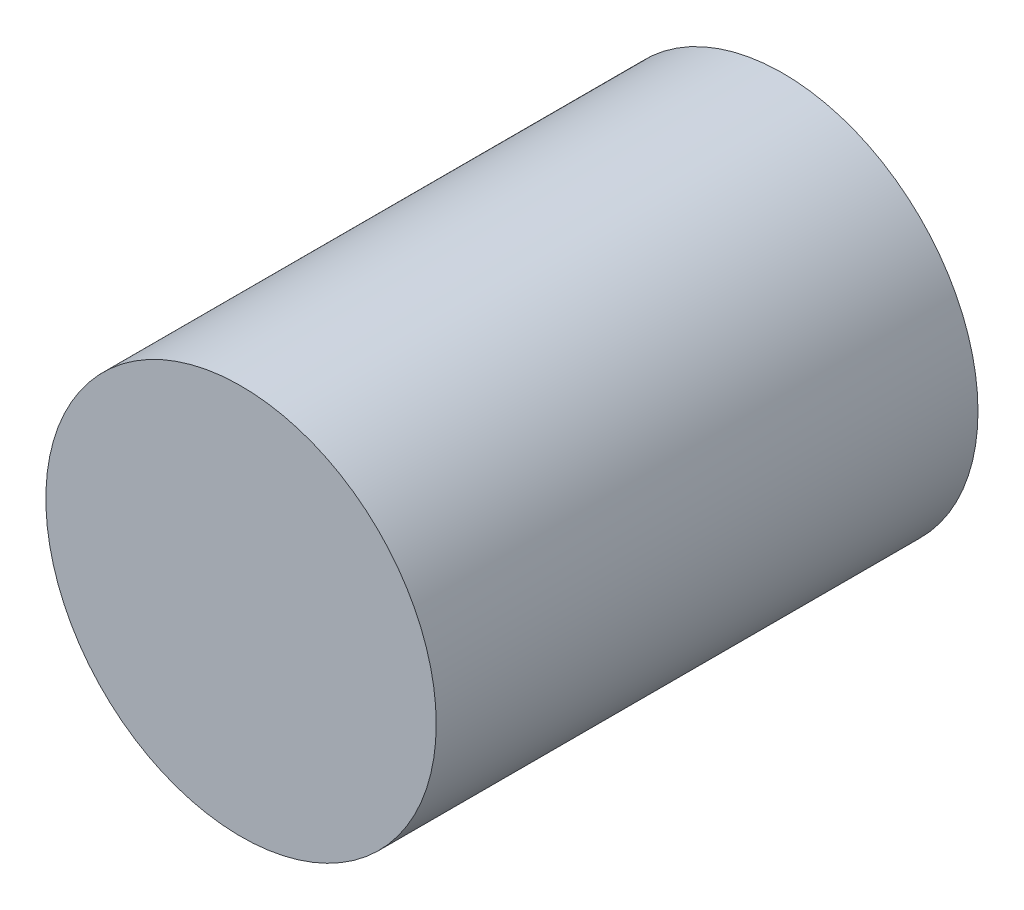
ISO-10303-21;
HEADER;
FILE_DESCRIPTION(('STEP AP214'),'2;1');
FILE_NAME('part.step','',(''),(''),'','','');
FILE_SCHEMA(('AUTOMOTIVE_DESIGN { 1 0 10303 214 1 1 1 1 }'));
ENDSEC;
DATA;
#1=APPLICATION_CONTEXT('core data for automotive mechanical design processes');
#2=APPLICATION_PROTOCOL_DEFINITION('international standard','automotive_design',2000,#1);
#3=PRODUCT_CONTEXT('',#1,'mechanical');
#4=PRODUCT('Part','Part','',(#3));
#5=PRODUCT_RELATED_PRODUCT_CATEGORY('part','',(#4));
#6=PRODUCT_DEFINITION_FORMATION('','',#4);
#7=PRODUCT_DEFINITION_CONTEXT('part definition',#1,'design');
#8=PRODUCT_DEFINITION('design','',#6,#7);
#9=PRODUCT_DEFINITION_SHAPE('','',#8);
#10=(LENGTH_UNIT() NAMED_UNIT(*) SI_UNIT(.MILLI.,.METRE.));
#11=(NAMED_UNIT(*) PLANE_ANGLE_UNIT() SI_UNIT($,.RADIAN.));
#12=(NAMED_UNIT(*) SI_UNIT($,.STERADIAN.) SOLID_ANGLE_UNIT());
#13=UNCERTAINTY_MEASURE_WITH_UNIT(LENGTH_MEASURE(1.E-05),#10,'distance_accuracy_value','');
#14=(GEOMETRIC_REPRESENTATION_CONTEXT(3) GLOBAL_UNCERTAINTY_ASSIGNED_CONTEXT((#13)) GLOBAL_UNIT_ASSIGNED_CONTEXT((#10,
#11,#12)) REPRESENTATION_CONTEXT('',''));
#15=CARTESIAN_POINT('',(0.,0.,0.));
#16=DIRECTION('',(0.,0.,1.));
#17=DIRECTION('',(1.,0.,0.));
#18=AXIS2_PLACEMENT_3D('',#15,#16,#17);
#19=CARTESIAN_POINT('',(0.,0.,13.49375));
#20=DIRECTION('',(0.,0.,-1.));
#21=DIRECTION('',(-1.,0.,0.));
#22=AXIS2_PLACEMENT_3D('',#19,#20,#21);
#23=CYLINDRICAL_SURFACE('',#22,9.72312);
#24=CARTESIAN_POINT('',(0.,0.,13.49375));
#25=DIRECTION('',(0.,0.,1.));
#26=DIRECTION('',(1.,0.,0.));
#27=AXIS2_PLACEMENT_3D('',#24,#25,#26);
#28=CIRCLE('',#27,9.72312);
#29=CARTESIAN_POINT('',(9.72312,0.,13.49375));
#30=VERTEX_POINT('',#29);
#31=EDGE_CURVE('E10',#30,#30,#28,.T.);
#32=ORIENTED_EDGE('',*,*,#31,.F.);
#33=EDGE_LOOP('',(#32));
#34=FACE_BOUND('',#33,.T.);
#35=CARTESIAN_POINT('',(0.,0.,-13.49375));
#36=DIRECTION('',(0.,0.,1.));
#37=DIRECTION('',(1.,0.,0.));
#38=AXIS2_PLACEMENT_3D('',#35,#36,#37);
#39=CIRCLE('',#38,9.72312);
#40=CARTESIAN_POINT('',(9.72312,0.,-13.49375));
#41=VERTEX_POINT('',#40);
#42=EDGE_CURVE('E42',#41,#41,#39,.T.);
#43=ORIENTED_EDGE('',*,*,#42,.T.);
#44=EDGE_LOOP('',(#43));
#45=FACE_BOUND('',#44,.T.);
#46=ADVANCED_FACE('F39',(#34,#45),#23,.T.);
#47=CARTESIAN_POINT('',(0.,0.,13.49375));
#48=DIRECTION('',(0.,0.,1.));
#49=DIRECTION('',(1.,0.,0.));
#50=AXIS2_PLACEMENT_3D('',#47,#48,#49);
#51=PLANE('',#50);
#52=ORIENTED_EDGE('',*,*,#31,.T.);
#53=EDGE_LOOP('',(#52));
#54=FACE_BOUND('',#53,.T.);
#55=ADVANCED_FACE('F54',(#54),#51,.T.);
#56=CARTESIAN_POINT('',(0.,0.,-13.49375));
#57=DIRECTION('',(0.,0.,1.));
#58=DIRECTION('',(1.,0.,0.));
#59=AXIS2_PLACEMENT_3D('',#56,#57,#58);
#60=PLANE('',#59);
#61=ORIENTED_EDGE('',*,*,#42,.F.);
#62=EDGE_LOOP('',(#61));
#63=FACE_BOUND('',#62,.T.);
#64=ADVANCED_FACE('F52',(#63),#60,.F.);
#65=CLOSED_SHELL('',(#46,#55,#64));
#66=MANIFOLD_SOLID_BREP('B2',#65);
#67=ADVANCED_BREP_SHAPE_REPRESENTATION('',(#18,#66),#14);
#68=SHAPE_DEFINITION_REPRESENTATION(#9,#67);
ENDSEC;
END-ISO-10303-21;
